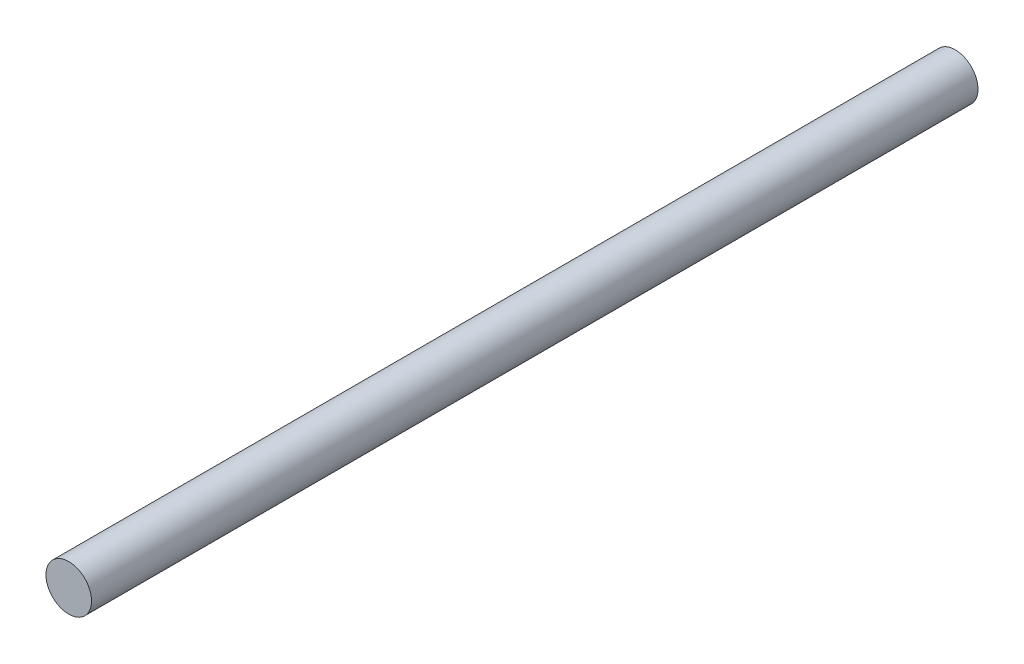
ISO-10303-21;
HEADER;
FILE_DESCRIPTION(('STEP AP214'),'2;1');
FILE_NAME('part.step','',(''),(''),'','','');
FILE_SCHEMA(('AUTOMOTIVE_DESIGN { 1 0 10303 214 1 1 1 1 }'));
ENDSEC;
DATA;
#1=APPLICATION_CONTEXT('core data for automotive mechanical design processes');
#2=APPLICATION_PROTOCOL_DEFINITION('international standard','automotive_design',2000,#1);
#3=PRODUCT_CONTEXT('',#1,'mechanical');
#4=PRODUCT('Part','Part','',(#3));
#5=PRODUCT_RELATED_PRODUCT_CATEGORY('part','',(#4));
#6=PRODUCT_DEFINITION_FORMATION('','',#4);
#7=PRODUCT_DEFINITION_CONTEXT('part definition',#1,'design');
#8=PRODUCT_DEFINITION('design','',#6,#7);
#9=PRODUCT_DEFINITION_SHAPE('','',#8);
#10=(LENGTH_UNIT() NAMED_UNIT(*) SI_UNIT(.MILLI.,.METRE.));
#11=(NAMED_UNIT(*) PLANE_ANGLE_UNIT() SI_UNIT($,.RADIAN.));
#12=(NAMED_UNIT(*) SI_UNIT($,.STERADIAN.) SOLID_ANGLE_UNIT());
#13=UNCERTAINTY_MEASURE_WITH_UNIT(LENGTH_MEASURE(1.E-05),#10,'distance_accuracy_value','');
#14=(GEOMETRIC_REPRESENTATION_CONTEXT(3) GLOBAL_UNCERTAINTY_ASSIGNED_CONTEXT((#13)) GLOBAL_UNIT_ASSIGNED_CONTEXT((#10,
#11,#12)) REPRESENTATION_CONTEXT('',''));
#15=CARTESIAN_POINT('',(0.,0.,0.));
#16=DIRECTION('',(0.,0.,1.));
#17=DIRECTION('',(1.,0.,0.));
#18=AXIS2_PLACEMENT_3D('',#15,#16,#17);
#19=CARTESIAN_POINT('',(0.,0.,563.88));
#20=DIRECTION('',(0.,0.,-1.));
#21=DIRECTION('',(-1.,0.,0.));
#22=AXIS2_PLACEMENT_3D('',#19,#20,#21);
#23=CYLINDRICAL_SURFACE('',#22,14.5034);
#24=CARTESIAN_POINT('',(0.,0.,563.88));
#25=DIRECTION('',(0.,0.,1.));
#26=DIRECTION('',(1.,0.,0.));
#27=AXIS2_PLACEMENT_3D('',#24,#25,#26);
#28=CIRCLE('',#27,14.5034);
#29=CARTESIAN_POINT('',(14.5034,0.,563.88));
#30=VERTEX_POINT('',#29);
#31=EDGE_CURVE('E12',#30,#30,#28,.T.);
#32=ORIENTED_EDGE('',*,*,#31,.F.);
#33=EDGE_LOOP('',(#32));
#34=FACE_BOUND('',#33,.T.);
#35=CARTESIAN_POINT('',(0.,0.,0.));
#36=DIRECTION('',(0.,0.,1.));
#37=DIRECTION('',(1.,0.,0.));
#38=AXIS2_PLACEMENT_3D('',#35,#36,#37);
#39=CIRCLE('',#38,14.5034);
#40=CARTESIAN_POINT('',(14.5034,0.,0.));
#41=VERTEX_POINT('',#40);
#42=EDGE_CURVE('E43',#41,#41,#39,.T.);
#43=ORIENTED_EDGE('',*,*,#42,.T.);
#44=EDGE_LOOP('',(#43));
#45=FACE_BOUND('',#44,.T.);
#46=ADVANCED_FACE('F40',(#34,#45),#23,.T.);
#47=CARTESIAN_POINT('',(0.,0.,563.88));
#48=DIRECTION('',(0.,0.,1.));
#49=DIRECTION('',(1.,0.,0.));
#50=AXIS2_PLACEMENT_3D('',#47,#48,#49);
#51=PLANE('',#50);
#52=ORIENTED_EDGE('',*,*,#31,.T.);
#53=EDGE_LOOP('',(#52));
#54=FACE_BOUND('',#53,.T.);
#55=ADVANCED_FACE('F55',(#54),#51,.T.);
#56=CARTESIAN_POINT('',(0.,0.,0.));
#57=DIRECTION('',(0.,0.,1.));
#58=DIRECTION('',(1.,0.,0.));
#59=AXIS2_PLACEMENT_3D('',#56,#57,#58);
#60=PLANE('',#59);
#61=ORIENTED_EDGE('',*,*,#42,.F.);
#62=EDGE_LOOP('',(#61));
#63=FACE_BOUND('',#62,.T.);
#64=ADVANCED_FACE('F53',(#63),#60,.F.);
#65=CLOSED_SHELL('',(#46,#55,#64));
#66=MANIFOLD_SOLID_BREP('B2',#65);
#67=ADVANCED_BREP_SHAPE_REPRESENTATION('',(#18,#66),#14);
#68=SHAPE_DEFINITION_REPRESENTATION(#9,#67);
ENDSEC;
END-ISO-10303-21;
